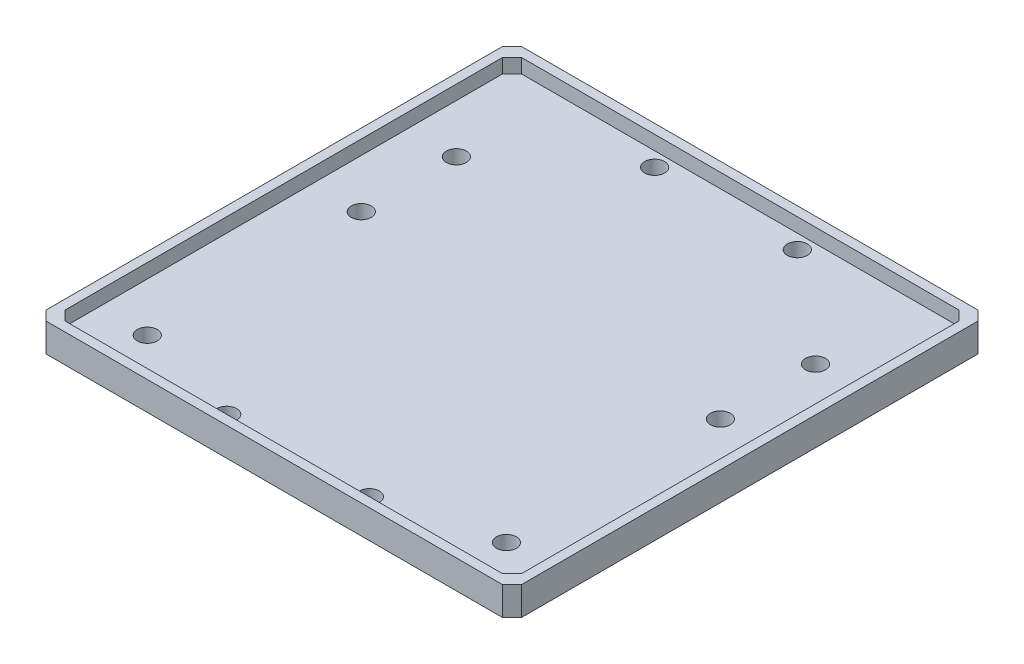
ISO-10303-21;
HEADER;
FILE_DESCRIPTION(('STEP AP214'),'2;1');
FILE_NAME('part.step','',(''),(''),'','','');
FILE_SCHEMA(('AUTOMOTIVE_DESIGN { 1 0 10303 214 1 1 1 1 }'));
ENDSEC;
DATA;
#1=APPLICATION_CONTEXT('core data for automotive mechanical design processes');
#2=APPLICATION_PROTOCOL_DEFINITION('international standard','automotive_design',2000,#1);
#3=PRODUCT_CONTEXT('',#1,'mechanical');
#4=PRODUCT('Part','Part','',(#3));
#5=PRODUCT_RELATED_PRODUCT_CATEGORY('part','',(#4));
#6=PRODUCT_DEFINITION_FORMATION('','',#4);
#7=PRODUCT_DEFINITION_CONTEXT('part definition',#1,'design');
#8=PRODUCT_DEFINITION('design','',#6,#7);
#9=PRODUCT_DEFINITION_SHAPE('','',#8);
#10=(LENGTH_UNIT() NAMED_UNIT(*) SI_UNIT(.MILLI.,.METRE.));
#11=(NAMED_UNIT(*) PLANE_ANGLE_UNIT() SI_UNIT($,.RADIAN.));
#12=(NAMED_UNIT(*) SI_UNIT($,.STERADIAN.) SOLID_ANGLE_UNIT());
#13=UNCERTAINTY_MEASURE_WITH_UNIT(LENGTH_MEASURE(1.E-05),#10,'distance_accuracy_value','');
#14=(GEOMETRIC_REPRESENTATION_CONTEXT(3) GLOBAL_UNCERTAINTY_ASSIGNED_CONTEXT((#13)) GLOBAL_UNIT_ASSIGNED_CONTEXT((#10,
#11,#12)) REPRESENTATION_CONTEXT('',''));
#15=CARTESIAN_POINT('',(0.,0.,0.));
#16=DIRECTION('',(0.,0.,1.));
#17=DIRECTION('',(1.,0.,0.));
#18=AXIS2_PLACEMENT_3D('',#15,#16,#17);
#19=CARTESIAN_POINT('',(0.,3.,0.));
#20=DIRECTION('',(0.,1.,0.));
#21=DIRECTION('',(0.,0.,1.));
#22=AXIS2_PLACEMENT_3D('',#19,#20,#21);
#23=PLANE('',#22);
#24=CARTESIAN_POINT('',(77.2035074999913,3.,87.3604147454228));
#25=DIRECTION('',(0.,1.,0.));
#26=DIRECTION('',(0.,0.,-1.));
#27=AXIS2_PLACEMENT_3D('',#24,#25,#26);
#28=CIRCLE('',#27,2.09999999999997);
#29=CARTESIAN_POINT('',(77.2035074999913,3.,85.2604147454228));
#30=VERTEX_POINT('',#29);
#31=EDGE_CURVE('E213',#30,#30,#28,.T.);
#32=ORIENTED_EDGE('',*,*,#31,.F.);
#33=EDGE_LOOP('',(#32));
#34=FACE_BOUND('',#33,.T.);
#35=CARTESIAN_POINT('',(77.2035074999913,3.,152.360414745423));
#36=DIRECTION('',(0.,1.,0.));
#37=DIRECTION('',(0.,0.,-1.));
#38=AXIS2_PLACEMENT_3D('',#35,#36,#37);
#39=CIRCLE('',#38,2.09999999999999);
#40=CARTESIAN_POINT('',(77.2035074999913,3.,150.260414745423));
#41=VERTEX_POINT('',#40);
#42=EDGE_CURVE('E229',#41,#41,#39,.T.);
#43=ORIENTED_EDGE('',*,*,#42,.F.);
#44=EDGE_LOOP('',(#43));
#45=FACE_BOUND('',#44,.T.);
#46=CARTESIAN_POINT('',(24.4441539849667,3.,68.4248216350618));
#47=DIRECTION('',(0.,1.,0.));
#48=DIRECTION('',(0.,0.,1.));
#49=AXIS2_PLACEMENT_3D('',#46,#47,#48);
#50=CIRCLE('',#49,2.1);
#51=CARTESIAN_POINT('',(24.4441539849667,3.,70.5248216350618));
#52=VERTEX_POINT('',#51);
#53=EDGE_CURVE('E245',#52,#52,#50,.T.);
#54=ORIENTED_EDGE('',*,*,#53,.F.);
#55=EDGE_LOOP('',(#54));
#56=FACE_BOUND('',#55,.T.);
#57=CARTESIAN_POINT('',(1.68480046994186,3.,152.360414745423));
#58=DIRECTION('',(0.,1.,0.));
#59=DIRECTION('',(0.,0.,1.));
#60=AXIS2_PLACEMENT_3D('',#57,#58,#59);
#61=CIRCLE('',#60,2.1);
#62=CARTESIAN_POINT('',(1.68480046994186,3.,154.460414745423));
#63=VERTEX_POINT('',#62);
#64=EDGE_CURVE('E261',#63,#63,#61,.T.);
#65=ORIENTED_EDGE('',*,*,#64,.F.);
#66=EDGE_LOOP('',(#65));
#67=FACE_BOUND('',#66,.T.);
#68=CARTESIAN_POINT('',(1.68480046994187,3.,87.3604147454228));
#69=DIRECTION('',(0.,1.,0.));
#70=DIRECTION('',(0.,0.,1.));
#71=AXIS2_PLACEMENT_3D('',#68,#69,#70);
#72=CIRCLE('',#71,2.09999999999998);
#73=CARTESIAN_POINT('',(1.68480046994187,3.,89.4604147454228));
#74=VERTEX_POINT('',#73);
#75=EDGE_CURVE('E277',#74,#74,#72,.T.);
#76=ORIENTED_EDGE('',*,*,#75,.F.);
#77=EDGE_LOOP('',(#76));
#78=FACE_BOUND('',#77,.T.);
#79=CARTESIAN_POINT('',(1.68480046994187,3.,107.360414745423));
#80=DIRECTION('',(0.,1.,0.));
#81=DIRECTION('',(0.,0.,1.));
#82=AXIS2_PLACEMENT_3D('',#79,#80,#81);
#83=CIRCLE('',#82,2.10000000000001);
#84=CARTESIAN_POINT('',(1.68480046994187,3.,109.460414745423));
#85=VERTEX_POINT('',#84);
#86=EDGE_CURVE('E269',#85,#85,#83,.T.);
#87=ORIENTED_EDGE('',*,*,#86,.F.);
#88=EDGE_LOOP('',(#87));
#89=FACE_BOUND('',#88,.T.);
#90=CARTESIAN_POINT('',(24.4441539849667,3.,158.424821635062));
#91=DIRECTION('',(0.,1.,0.));
#92=DIRECTION('',(0.,0.,1.));
#93=AXIS2_PLACEMENT_3D('',#90,#91,#92);
#94=CIRCLE('',#93,2.09999999999999);
#95=CARTESIAN_POINT('',(24.4441539849667,3.,160.524821635062));
#96=VERTEX_POINT('',#95);
#97=EDGE_CURVE('E253',#96,#96,#94,.T.);
#98=ORIENTED_EDGE('',*,*,#97,.F.);
#99=EDGE_LOOP('',(#98));
#100=FACE_BOUND('',#99,.T.);
#101=CARTESIAN_POINT('',(54.4441539849665,3.,158.424821635062));
#102=DIRECTION('',(0.,1.,0.));
#103=DIRECTION('',(0.,0.,-1.));
#104=AXIS2_PLACEMENT_3D('',#101,#102,#103);
#105=CIRCLE('',#104,2.09999999999999);
#106=CARTESIAN_POINT('',(54.4441539849665,3.,156.324821635062));
#107=VERTEX_POINT('',#106);
#108=EDGE_CURVE('E237',#107,#107,#105,.T.);
#109=ORIENTED_EDGE('',*,*,#108,.F.);
#110=EDGE_LOOP('',(#109));
#111=FACE_BOUND('',#110,.T.);
#112=CARTESIAN_POINT('',(77.2035074999913,3.,107.360414745423));
#113=DIRECTION('',(0.,1.,0.));
#114=DIRECTION('',(0.,0.,-1.));
#115=AXIS2_PLACEMENT_3D('',#112,#113,#114);
#116=CIRCLE('',#115,2.10000000000002);
#117=CARTESIAN_POINT('',(77.2035074999913,3.,105.260414745423));
#118=VERTEX_POINT('',#117);
#119=EDGE_CURVE('E221',#118,#118,#116,.T.);
#120=ORIENTED_EDGE('',*,*,#119,.F.);
#121=EDGE_LOOP('',(#120));
#122=FACE_BOUND('',#121,.T.);
#123=CARTESIAN_POINT('',(54.4441539849665,3.,68.4248216350618));
#124=DIRECTION('',(0.,1.,0.));
#125=DIRECTION('',(0.,0.,-1.));
#126=AXIS2_PLACEMENT_3D('',#123,#124,#125);
#127=CIRCLE('',#126,2.1);
#128=CARTESIAN_POINT('',(54.4441539849665,3.,66.3248216350618));
#129=VERTEX_POINT('',#128);
#130=EDGE_CURVE('E203',#129,#129,#127,.T.);
#131=ORIENTED_EDGE('',*,*,#130,.F.);
#132=EDGE_LOOP('',(#131));
#133=FACE_BOUND('',#132,.T.);
#134=DIRECTION('',(0.,0.,-1.));
#135=VECTOR('',#134,1.);
#136=CARTESIAN_POINT('',(-8.55584601503339,3.,163.424821635062));
#137=LINE('',#136,#135);
#138=CARTESIAN_POINT('',(-8.55584601503339,3.,159.424821635062));
#139=VERTEX_POINT('',#138);
#140=CARTESIAN_POINT('',(-8.55584601503339,3.,67.4248216350618));
#141=VERTEX_POINT('',#140);
#142=EDGE_CURVE('E187',#139,#141,#137,.T.);
#143=ORIENTED_EDGE('',*,*,#142,.F.);
#144=DIRECTION('',(-0.707106781186547,0.,-0.707106781186548));
#145=VECTOR('',#144,1.);
#146=CARTESIAN_POINT('',(-6.55584601503339,3.,161.424821635062));
#147=LINE('',#146,#145);
#148=CARTESIAN_POINT('',(-6.55584601503339,3.,161.424821635062));
#149=VERTEX_POINT('',#148);
#150=EDGE_CURVE('E170',#149,#139,#147,.T.);
#151=ORIENTED_EDGE('',*,*,#150,.F.);
#152=DIRECTION('',(-1.,0.,0.));
#153=VECTOR('',#152,1.);
#154=CARTESIAN_POINT('',(-8.55584601503339,3.,161.424821635062));
#155=LINE('',#154,#153);
#156=CARTESIAN_POINT('',(85.4441539849666,3.,161.424821635062));
#157=VERTEX_POINT('',#156);
#158=EDGE_CURVE('E534',#157,#149,#155,.T.);
#159=ORIENTED_EDGE('',*,*,#158,.F.);
#160=DIRECTION('',(-0.707106781186545,0.,0.70710678118655));
#161=VECTOR('',#160,1.);
#162=CARTESIAN_POINT('',(85.4441539849666,3.,161.424821635062));
#163=LINE('',#162,#161);
#164=CARTESIAN_POINT('',(87.4441539849666,3.,159.424821635062));
#165=VERTEX_POINT('',#164);
#166=EDGE_CURVE('E179',#165,#157,#163,.T.);
#167=ORIENTED_EDGE('',*,*,#166,.F.);
#168=DIRECTION('',(0.,0.,-1.));
#169=VECTOR('',#168,1.);
#170=CARTESIAN_POINT('',(87.4441539849667,3.,0.));
#171=LINE('',#170,#169);
#172=CARTESIAN_POINT('',(87.4441539849666,3.,67.4248216350618));
#173=VERTEX_POINT('',#172);
#174=EDGE_CURVE('E196',#165,#173,#171,.T.);
#175=ORIENTED_EDGE('',*,*,#174,.T.);
#176=DIRECTION('',(0.707106781186545,0.,0.70710678118655));
#177=VECTOR('',#176,1.);
#178=CARTESIAN_POINT('',(85.4441539849666,3.,65.4248216350618));
#179=LINE('',#178,#177);
#180=CARTESIAN_POINT('',(85.4441539849666,3.,65.4248216350618));
#181=VERTEX_POINT('',#180);
#182=EDGE_CURVE('E559',#181,#173,#179,.T.);
#183=ORIENTED_EDGE('',*,*,#182,.F.);
#184=DIRECTION('',(1.,0.,0.));
#185=VECTOR('',#184,1.);
#186=CARTESIAN_POINT('',(0.,3.,65.4248216350618));
#187=LINE('',#186,#185);
#188=CARTESIAN_POINT('',(-6.55584601503339,3.,65.4248216350618));
#189=VERTEX_POINT('',#188);
#190=EDGE_CURVE('E201',#189,#181,#187,.T.);
#191=ORIENTED_EDGE('',*,*,#190,.F.);
#192=DIRECTION('',(0.707106781186547,0.,-0.707106781186548));
#193=VECTOR('',#192,1.);
#194=CARTESIAN_POINT('',(-6.55584601503339,3.,65.4248216350618));
#195=LINE('',#194,#193);
#196=EDGE_CURVE('E531',#141,#189,#195,.T.);
#197=ORIENTED_EDGE('',*,*,#196,.F.);
#198=EDGE_LOOP('',(#143,#151,#159,#167,#175,#183,#191,#197));
#199=FACE_BOUND('',#198,.T.);
#200=ADVANCED_FACE('F43',(#34,#45,#56,#67,#78,#89,#100,#111,#122,#133,#199),#23,.T.);
#201=CARTESIAN_POINT('',(-8.55584601503339,6.,161.424821635062));
#202=DIRECTION('',(0.,0.,1.));
#203=DIRECTION('',(1.,0.,0.));
#204=AXIS2_PLACEMENT_3D('',#201,#202,#203);
#205=PLANE('',#204);
#206=DIRECTION('',(0.,-1.,0.));
#207=VECTOR('',#206,1.);
#208=CARTESIAN_POINT('',(-6.55584601503339,6.,161.424821635062));
#209=LINE('',#208,#207);
#210=CARTESIAN_POINT('',(-6.55584601503339,6.,161.424821635062));
#211=VERTEX_POINT('',#210);
#212=EDGE_CURVE('E169',#211,#149,#209,.T.);
#213=ORIENTED_EDGE('',*,*,#212,.F.);
#214=DIRECTION('',(-1.,0.,0.));
#215=VECTOR('',#214,1.);
#216=CARTESIAN_POINT('',(-8.55584601503339,6.,161.424821635062));
#217=LINE('',#216,#215);
#218=CARTESIAN_POINT('',(85.4441539849666,6.,161.424821635062));
#219=VERTEX_POINT('',#218);
#220=EDGE_CURVE('E165',#219,#211,#217,.T.);
#221=ORIENTED_EDGE('',*,*,#220,.F.);
#222=DIRECTION('',(0.,-1.,0.));
#223=VECTOR('',#222,1.);
#224=CARTESIAN_POINT('',(85.4441539849666,6.,161.424821635062));
#225=LINE('',#224,#223);
#226=EDGE_CURVE('E60',#219,#157,#225,.T.);
#227=ORIENTED_EDGE('',*,*,#226,.T.);
#228=ORIENTED_EDGE('',*,*,#158,.T.);
#229=EDGE_LOOP('',(#213,#221,#227,#228));
#230=FACE_BOUND('',#229,.T.);
#231=ADVANCED_FACE('F398',(#230),#205,.F.);
#232=CARTESIAN_POINT('',(-8.55584601503339,6.,163.424821635062));
#233=DIRECTION('',(-1.,0.,0.));
#234=DIRECTION('',(0.,0.,1.));
#235=AXIS2_PLACEMENT_3D('',#232,#233,#234);
#236=PLANE('',#235);
#237=DIRECTION('',(0.,-1.,0.));
#238=VECTOR('',#237,1.);
#239=CARTESIAN_POINT('',(-8.55584601503339,6.,159.424821635062));
#240=LINE('',#239,#238);
#241=CARTESIAN_POINT('',(-8.55584601503339,6.,159.424821635062));
#242=VERTEX_POINT('',#241);
#243=EDGE_CURVE('E173',#242,#139,#240,.T.);
#244=ORIENTED_EDGE('',*,*,#243,.T.);
#245=ORIENTED_EDGE('',*,*,#142,.T.);
#246=DIRECTION('',(0.,-1.,0.));
#247=VECTOR('',#246,1.);
#248=CARTESIAN_POINT('',(-8.55584601503339,6.,67.4248216350618));
#249=LINE('',#248,#247);
#250=CARTESIAN_POINT('',(-8.55584601503339,6.,67.4248216350618));
#251=VERTEX_POINT('',#250);
#252=EDGE_CURVE('E184',#251,#141,#249,.T.);
#253=ORIENTED_EDGE('',*,*,#252,.F.);
#254=DIRECTION('',(0.,0.,-1.));
#255=VECTOR('',#254,1.);
#256=CARTESIAN_POINT('',(-8.55584601503339,6.,163.424821635062));
#257=LINE('',#256,#255);
#258=EDGE_CURVE('E163',#242,#251,#257,.T.);
#259=ORIENTED_EDGE('',*,*,#258,.F.);
#260=EDGE_LOOP('',(#244,#245,#253,#259));
#261=FACE_BOUND('',#260,.T.);
#262=ADVANCED_FACE('F182',(#261),#236,.F.);
#263=CARTESIAN_POINT('',(87.4441539849667,6.,0.));
#264=DIRECTION('',(-1.,0.,0.));
#265=DIRECTION('',(0.,0.,1.));
#266=AXIS2_PLACEMENT_3D('',#263,#264,#265);
#267=PLANE('',#266);
#268=ORIENTED_EDGE('',*,*,#174,.F.);
#269=DIRECTION('',(0.,-1.,0.));
#270=VECTOR('',#269,1.);
#271=CARTESIAN_POINT('',(87.4441539849666,6.,159.424821635062));
#272=LINE('',#271,#270);
#273=CARTESIAN_POINT('',(87.4441539849666,6.,159.424821635062));
#274=VERTEX_POINT('',#273);
#275=EDGE_CURVE('E569',#274,#165,#272,.T.);
#276=ORIENTED_EDGE('',*,*,#275,.F.);
#277=DIRECTION('',(0.,0.,-1.));
#278=VECTOR('',#277,1.);
#279=CARTESIAN_POINT('',(87.4441539849667,6.,0.));
#280=LINE('',#279,#278);
#281=CARTESIAN_POINT('',(87.4441539849666,6.,67.4248216350618));
#282=VERTEX_POINT('',#281);
#283=EDGE_CURVE('E358',#274,#282,#280,.T.);
#284=ORIENTED_EDGE('',*,*,#283,.T.);
#285=DIRECTION('',(0.,-1.,0.));
#286=VECTOR('',#285,1.);
#287=CARTESIAN_POINT('',(87.4441539849666,6.,67.4248216350618));
#288=LINE('',#287,#286);
#289=EDGE_CURVE('E565',#282,#173,#288,.T.);
#290=ORIENTED_EDGE('',*,*,#289,.T.);
#291=EDGE_LOOP('',(#268,#276,#284,#290));
#292=FACE_BOUND('',#291,.T.);
#293=ADVANCED_FACE('F447',(#292),#267,.T.);
#294=CARTESIAN_POINT('',(0.,6.,65.4248216350618));
#295=DIRECTION('',(0.,0.,-1.));
#296=DIRECTION('',(-1.,0.,0.));
#297=AXIS2_PLACEMENT_3D('',#294,#295,#296);
#298=PLANE('',#297);
#299=DIRECTION('',(0.,-1.,0.));
#300=VECTOR('',#299,1.);
#301=CARTESIAN_POINT('',(85.4441539849666,6.,65.4248216350618));
#302=LINE('',#301,#300);
#303=CARTESIAN_POINT('',(85.4441539849666,6.,65.4248216350618));
#304=VERTEX_POINT('',#303);
#305=EDGE_CURVE('E566',#304,#181,#302,.T.);
#306=ORIENTED_EDGE('',*,*,#305,.F.);
#307=DIRECTION('',(1.,0.,0.));
#308=VECTOR('',#307,1.);
#309=CARTESIAN_POINT('',(0.,6.,65.4248216350618));
#310=LINE('',#309,#308);
#311=CARTESIAN_POINT('',(-6.55584601503339,6.,65.4248216350618));
#312=VERTEX_POINT('',#311);
#313=EDGE_CURVE('E546',#312,#304,#310,.T.);
#314=ORIENTED_EDGE('',*,*,#313,.F.);
#315=DIRECTION('',(0.,-1.,0.));
#316=VECTOR('',#315,1.);
#317=CARTESIAN_POINT('',(-6.55584601503339,6.,65.4248216350618));
#318=LINE('',#317,#316);
#319=EDGE_CURVE('E68',#312,#189,#318,.T.);
#320=ORIENTED_EDGE('',*,*,#319,.T.);
#321=ORIENTED_EDGE('',*,*,#190,.T.);
#322=EDGE_LOOP('',(#306,#314,#320,#321));
#323=FACE_BOUND('',#322,.T.);
#324=ADVANCED_FACE('F414',(#323),#298,.F.);
#325=CARTESIAN_POINT('',(0.,0.,0.));
#326=DIRECTION('',(0.,1.,0.));
#327=DIRECTION('',(0.,0.,1.));
#328=AXIS2_PLACEMENT_3D('',#325,#326,#327);
#329=PLANE('',#328);
#330=DIRECTION('',(0.,0.,1.));
#331=VECTOR('',#330,1.);
#332=CARTESIAN_POINT('',(-10.5558460150334,0.,63.4248216350618));
#333=LINE('',#332,#331);
#334=CARTESIAN_POINT('',(-10.5558460150334,0.,65.4248216350618));
#335=VERTEX_POINT('',#334);
#336=CARTESIAN_POINT('',(-10.5558460150334,0.,161.424821635062));
#337=VERTEX_POINT('',#336);
#338=EDGE_CURVE('E281',#335,#337,#333,.T.);
#339=ORIENTED_EDGE('',*,*,#338,.F.);
#340=DIRECTION('',(-0.70710678118655,0.,0.707106781186545));
#341=VECTOR('',#340,1.);
#342=CARTESIAN_POINT('',(-10.5558460150334,0.,65.4248216350618));
#343=LINE('',#342,#341);
#344=CARTESIAN_POINT('',(-8.55584601503337,0.,63.4248216350618));
#345=VERTEX_POINT('',#344);
#346=EDGE_CURVE('E316',#335,#345,#343,.F.);
#347=ORIENTED_EDGE('',*,*,#346,.T.);
#348=DIRECTION('',(-1.,0.,0.));
#349=VECTOR('',#348,1.);
#350=CARTESIAN_POINT('',(-10.5558460150334,0.,63.4248216350618));
#351=LINE('',#350,#349);
#352=CARTESIAN_POINT('',(87.4441539849666,0.,63.4248216350618));
#353=VERTEX_POINT('',#352);
#354=EDGE_CURVE('E296',#353,#345,#351,.T.);
#355=ORIENTED_EDGE('',*,*,#354,.F.);
#356=DIRECTION('',(-0.707106781186545,0.,-0.70710678118655));
#357=VECTOR('',#356,1.);
#358=CARTESIAN_POINT('',(87.4441539849666,0.,63.4248216350618));
#359=LINE('',#358,#357);
#360=CARTESIAN_POINT('',(89.4441539849666,0.,65.4248216350618));
#361=VERTEX_POINT('',#360);
#362=EDGE_CURVE('E307',#353,#361,#359,.F.);
#363=ORIENTED_EDGE('',*,*,#362,.T.);
#364=DIRECTION('',(0.,0.,-1.));
#365=VECTOR('',#364,1.);
#366=CARTESIAN_POINT('',(89.4441539849666,0.,63.4248216350618));
#367=LINE('',#366,#365);
#368=CARTESIAN_POINT('',(89.4441539849666,0.,161.424821635062));
#369=VERTEX_POINT('',#368);
#370=EDGE_CURVE('E292',#369,#361,#367,.T.);
#371=ORIENTED_EDGE('',*,*,#370,.F.);
#372=DIRECTION('',(0.70710678118655,0.,-0.707106781186545));
#373=VECTOR('',#372,1.);
#374=CARTESIAN_POINT('',(89.4441539849666,0.,161.424821635062));
#375=LINE('',#374,#373);
#376=CARTESIAN_POINT('',(87.4441539849666,0.,163.424821635062));
#377=VERTEX_POINT('',#376);
#378=EDGE_CURVE('E310',#369,#377,#375,.F.);
#379=ORIENTED_EDGE('',*,*,#378,.T.);
#380=DIRECTION('',(1.,0.,0.));
#381=VECTOR('',#380,1.);
#382=CARTESIAN_POINT('',(-10.5558460150334,0.,163.424821635062));
#383=LINE('',#382,#381);
#384=CARTESIAN_POINT('',(-8.55584601503338,0.,163.424821635062));
#385=VERTEX_POINT('',#384);
#386=EDGE_CURVE('E288',#385,#377,#383,.T.);
#387=ORIENTED_EDGE('',*,*,#386,.F.);
#388=DIRECTION('',(0.707106781186543,0.,0.707106781186552));
#389=VECTOR('',#388,1.);
#390=CARTESIAN_POINT('',(-8.55584601503338,0.,163.424821635062));
#391=LINE('',#390,#389);
#392=EDGE_CURVE('E313',#385,#337,#391,.F.);
#393=ORIENTED_EDGE('',*,*,#392,.T.);
#394=EDGE_LOOP('',(#339,#347,#355,#363,#371,#379,#387,#393));
#395=FACE_BOUND('',#394,.T.);
#396=CARTESIAN_POINT('',(1.68480046994187,0.,87.3604147454228));
#397=DIRECTION('',(0.,1.,0.));
#398=DIRECTION('',(0.,0.,1.));
#399=AXIS2_PLACEMENT_3D('',#396,#397,#398);
#400=CIRCLE('',#399,2.09999999999998);
#401=CARTESIAN_POINT('',(1.68480046994187,0.,89.4604147454228));
#402=VERTEX_POINT('',#401);
#403=EDGE_CURVE('E273',#402,#402,#400,.T.);
#404=ORIENTED_EDGE('',*,*,#403,.T.);
#405=EDGE_LOOP('',(#404));
#406=FACE_BOUND('',#405,.T.);
#407=CARTESIAN_POINT('',(1.68480046994187,0.,107.360414745423));
#408=DIRECTION('',(0.,1.,0.));
#409=DIRECTION('',(0.,0.,1.));
#410=AXIS2_PLACEMENT_3D('',#407,#408,#409);
#411=CIRCLE('',#410,2.10000000000001);
#412=CARTESIAN_POINT('',(1.68480046994187,0.,109.460414745423));
#413=VERTEX_POINT('',#412);
#414=EDGE_CURVE('E265',#413,#413,#411,.T.);
#415=ORIENTED_EDGE('',*,*,#414,.T.);
#416=EDGE_LOOP('',(#415));
#417=FACE_BOUND('',#416,.T.);
#418=CARTESIAN_POINT('',(1.68480046994186,0.,152.360414745423));
#419=DIRECTION('',(0.,1.,0.));
#420=DIRECTION('',(0.,0.,1.));
#421=AXIS2_PLACEMENT_3D('',#418,#419,#420);
#422=CIRCLE('',#421,2.1);
#423=CARTESIAN_POINT('',(1.68480046994186,0.,154.460414745423));
#424=VERTEX_POINT('',#423);
#425=EDGE_CURVE('E257',#424,#424,#422,.T.);
#426=ORIENTED_EDGE('',*,*,#425,.T.);
#427=EDGE_LOOP('',(#426));
#428=FACE_BOUND('',#427,.T.);
#429=CARTESIAN_POINT('',(24.4441539849667,0.,158.424821635062));
#430=DIRECTION('',(0.,1.,0.));
#431=DIRECTION('',(0.,0.,1.));
#432=AXIS2_PLACEMENT_3D('',#429,#430,#431);
#433=CIRCLE('',#432,2.09999999999999);
#434=CARTESIAN_POINT('',(24.4441539849667,0.,160.524821635062));
#435=VERTEX_POINT('',#434);
#436=EDGE_CURVE('E249',#435,#435,#433,.T.);
#437=ORIENTED_EDGE('',*,*,#436,.T.);
#438=EDGE_LOOP('',(#437));
#439=FACE_BOUND('',#438,.T.);
#440=CARTESIAN_POINT('',(24.4441539849667,0.,68.4248216350618));
#441=DIRECTION('',(0.,1.,0.));
#442=DIRECTION('',(0.,0.,1.));
#443=AXIS2_PLACEMENT_3D('',#440,#441,#442);
#444=CIRCLE('',#443,2.1);
#445=CARTESIAN_POINT('',(24.4441539849667,0.,70.5248216350618));
#446=VERTEX_POINT('',#445);
#447=EDGE_CURVE('E241',#446,#446,#444,.T.);
#448=ORIENTED_EDGE('',*,*,#447,.T.);
#449=EDGE_LOOP('',(#448));
#450=FACE_BOUND('',#449,.T.);
#451=CARTESIAN_POINT('',(54.4441539849665,0.,158.424821635062));
#452=DIRECTION('',(0.,1.,0.));
#453=DIRECTION('',(0.,0.,-1.));
#454=AXIS2_PLACEMENT_3D('',#451,#452,#453);
#455=CIRCLE('',#454,2.09999999999999);
#456=CARTESIAN_POINT('',(54.4441539849665,0.,156.324821635062));
#457=VERTEX_POINT('',#456);
#458=EDGE_CURVE('E233',#457,#457,#455,.T.);
#459=ORIENTED_EDGE('',*,*,#458,.T.);
#460=EDGE_LOOP('',(#459));
#461=FACE_BOUND('',#460,.T.);
#462=CARTESIAN_POINT('',(77.2035074999913,0.,152.360414745423));
#463=DIRECTION('',(0.,1.,0.));
#464=DIRECTION('',(0.,0.,-1.));
#465=AXIS2_PLACEMENT_3D('',#462,#463,#464);
#466=CIRCLE('',#465,2.09999999999999);
#467=CARTESIAN_POINT('',(77.2035074999913,0.,150.260414745423));
#468=VERTEX_POINT('',#467);
#469=EDGE_CURVE('E225',#468,#468,#466,.T.);
#470=ORIENTED_EDGE('',*,*,#469,.T.);
#471=EDGE_LOOP('',(#470));
#472=FACE_BOUND('',#471,.T.);
#473=CARTESIAN_POINT('',(77.2035074999913,0.,107.360414745423));
#474=DIRECTION('',(0.,1.,0.));
#475=DIRECTION('',(0.,0.,-1.));
#476=AXIS2_PLACEMENT_3D('',#473,#474,#475);
#477=CIRCLE('',#476,2.10000000000002);
#478=CARTESIAN_POINT('',(77.2035074999913,0.,105.260414745423));
#479=VERTEX_POINT('',#478);
#480=EDGE_CURVE('E217',#479,#479,#477,.T.);
#481=ORIENTED_EDGE('',*,*,#480,.T.);
#482=EDGE_LOOP('',(#481));
#483=FACE_BOUND('',#482,.T.);
#484=CARTESIAN_POINT('',(77.2035074999913,0.,87.3604147454228));
#485=DIRECTION('',(0.,1.,0.));
#486=DIRECTION('',(0.,0.,-1.));
#487=AXIS2_PLACEMENT_3D('',#484,#485,#486);
#488=CIRCLE('',#487,2.09999999999997);
#489=CARTESIAN_POINT('',(77.2035074999913,0.,85.2604147454228));
#490=VERTEX_POINT('',#489);
#491=EDGE_CURVE('E207',#490,#490,#488,.T.);
#492=ORIENTED_EDGE('',*,*,#491,.T.);
#493=EDGE_LOOP('',(#492));
#494=FACE_BOUND('',#493,.T.);
#495=CARTESIAN_POINT('',(54.4441539849665,0.,68.4248216350618));
#496=DIRECTION('',(0.,1.,0.));
#497=DIRECTION('',(0.,0.,-1.));
#498=AXIS2_PLACEMENT_3D('',#495,#496,#497);
#499=CIRCLE('',#498,2.1);
#500=CARTESIAN_POINT('',(54.4441539849665,0.,66.3248216350618));
#501=VERTEX_POINT('',#500);
#502=EDGE_CURVE('E208',#501,#501,#499,.T.);
#503=ORIENTED_EDGE('',*,*,#502,.T.);
#504=EDGE_LOOP('',(#503));
#505=FACE_BOUND('',#504,.T.);
#506=ADVANCED_FACE('F368',(#395,#406,#417,#428,#439,#450,#461,#472,#483,#494,#505),#329,.F.);
#507=CARTESIAN_POINT('',(-10.5558460150334,3.,63.4248216350618));
#508=DIRECTION('',(1.,0.,0.));
#509=DIRECTION('',(0.,0.,-1.));
#510=AXIS2_PLACEMENT_3D('',#507,#508,#509);
#511=PLANE('',#510);
#512=DIRECTION('',(0.,0.,-1.));
#513=VECTOR('',#512,1.);
#514=CARTESIAN_POINT('',(-10.5558460150334,6.,163.424821635062));
#515=LINE('',#514,#513);
#516=CARTESIAN_POINT('',(-10.5558460150334,6.,161.424821635062));
#517=VERTEX_POINT('',#516);
#518=CARTESIAN_POINT('',(-10.5558460150334,6.,65.4248216350618));
#519=VERTEX_POINT('',#518);
#520=EDGE_CURVE('E186',#517,#519,#515,.T.);
#521=ORIENTED_EDGE('',*,*,#520,.T.);
#522=DIRECTION('',(0.,-1.,0.));
#523=VECTOR('',#522,1.);
#524=CARTESIAN_POINT('',(-10.5558460150334,3.,65.4248216350618));
#525=LINE('',#524,#523);
#526=EDGE_CURVE('E303',#519,#335,#525,.T.);
#527=ORIENTED_EDGE('',*,*,#526,.T.);
#528=ORIENTED_EDGE('',*,*,#338,.T.);
#529=DIRECTION('',(0.,1.,0.));
#530=VECTOR('',#529,1.);
#531=CARTESIAN_POINT('',(-10.5558460150334,3.,161.424821635062));
#532=LINE('',#531,#530);
#533=EDGE_CURVE('E300',#337,#517,#532,.T.);
#534=ORIENTED_EDGE('',*,*,#533,.T.);
#535=EDGE_LOOP('',(#521,#527,#528,#534));
#536=FACE_BOUND('',#535,.T.);
#537=ADVANCED_FACE('F375',(#536),#511,.F.);
#538=CARTESIAN_POINT('',(-10.5558460150334,3.,163.424821635062));
#539=DIRECTION('',(0.,0.,-1.));
#540=DIRECTION('',(-1.,0.,0.));
#541=AXIS2_PLACEMENT_3D('',#538,#539,#540);
#542=PLANE('',#541);
#543=DIRECTION('',(1.,0.,0.));
#544=VECTOR('',#543,1.);
#545=CARTESIAN_POINT('',(-10.5558460150334,6.,163.424821635062));
#546=LINE('',#545,#544);
#547=CARTESIAN_POINT('',(-8.55584601503338,6.,163.424821635062));
#548=VERTEX_POINT('',#547);
#549=CARTESIAN_POINT('',(87.4441539849666,6.,163.424821635062));
#550=VERTEX_POINT('',#549);
#551=EDGE_CURVE('E192',#548,#550,#546,.T.);
#552=ORIENTED_EDGE('',*,*,#551,.F.);
#553=DIRECTION('',(0.,-1.,0.));
#554=VECTOR('',#553,1.);
#555=CARTESIAN_POINT('',(-8.55584601503338,3.,163.424821635062));
#556=LINE('',#555,#554);
#557=EDGE_CURVE('E341',#548,#385,#556,.T.);
#558=ORIENTED_EDGE('',*,*,#557,.T.);
#559=ORIENTED_EDGE('',*,*,#386,.T.);
#560=DIRECTION('',(0.,1.,0.));
#561=VECTOR('',#560,1.);
#562=CARTESIAN_POINT('',(87.4441539849666,3.,163.424821635062));
#563=LINE('',#562,#561);
#564=EDGE_CURVE('E338',#377,#550,#563,.T.);
#565=ORIENTED_EDGE('',*,*,#564,.T.);
#566=EDGE_LOOP('',(#552,#558,#559,#565));
#567=FACE_BOUND('',#566,.T.);
#568=ADVANCED_FACE('F385',(#567),#542,.F.);
#569=CARTESIAN_POINT('',(89.4441539849666,3.,63.4248216350618));
#570=DIRECTION('',(-1.,0.,0.));
#571=DIRECTION('',(0.,0.,1.));
#572=AXIS2_PLACEMENT_3D('',#569,#570,#571);
#573=PLANE('',#572);
#574=DIRECTION('',(0.,0.,-1.));
#575=VECTOR('',#574,1.);
#576=CARTESIAN_POINT('',(89.4441539849666,6.,0.));
#577=LINE('',#576,#575);
#578=CARTESIAN_POINT('',(89.4441539849666,6.,161.424821635062));
#579=VERTEX_POINT('',#578);
#580=CARTESIAN_POINT('',(89.4441539849666,6.,65.4248216350618));
#581=VERTEX_POINT('',#580);
#582=EDGE_CURVE('E212',#579,#581,#577,.T.);
#583=ORIENTED_EDGE('',*,*,#582,.F.);
#584=DIRECTION('',(0.,-1.,0.));
#585=VECTOR('',#584,1.);
#586=CARTESIAN_POINT('',(89.4441539849666,3.,161.424821635062));
#587=LINE('',#586,#585);
#588=EDGE_CURVE('E11',#579,#369,#587,.T.);
#589=ORIENTED_EDGE('',*,*,#588,.T.);
#590=ORIENTED_EDGE('',*,*,#370,.T.);
#591=DIRECTION('',(0.,1.,0.));
#592=VECTOR('',#591,1.);
#593=CARTESIAN_POINT('',(89.4441539849666,3.,65.4248216350618));
#594=LINE('',#593,#592);
#595=EDGE_CURVE('E53',#361,#581,#594,.T.);
#596=ORIENTED_EDGE('',*,*,#595,.T.);
#597=EDGE_LOOP('',(#583,#589,#590,#596));
#598=FACE_BOUND('',#597,.T.);
#599=ADVANCED_FACE('F349',(#598),#573,.F.);
#600=CARTESIAN_POINT('',(-10.5558460150334,3.,63.4248216350618));
#601=DIRECTION('',(0.,0.,1.));
#602=DIRECTION('',(1.,0.,0.));
#603=AXIS2_PLACEMENT_3D('',#600,#601,#602);
#604=PLANE('',#603);
#605=ORIENTED_EDGE('',*,*,#354,.T.);
#606=DIRECTION('',(0.,1.,0.));
#607=VECTOR('',#606,1.);
#608=CARTESIAN_POINT('',(-8.55584601503337,3.,63.4248216350618));
#609=LINE('',#608,#607);
#610=CARTESIAN_POINT('',(-8.55584601503337,6.,63.4248216350618));
#611=VERTEX_POINT('',#610);
#612=EDGE_CURVE('E323',#345,#611,#609,.T.);
#613=ORIENTED_EDGE('',*,*,#612,.T.);
#614=DIRECTION('',(-1.,0.,0.));
#615=VECTOR('',#614,1.);
#616=CARTESIAN_POINT('',(0.,6.,63.4248216350618));
#617=LINE('',#616,#615);
#618=CARTESIAN_POINT('',(87.4441539849666,6.,63.4248216350618));
#619=VERTEX_POINT('',#618);
#620=EDGE_CURVE('E365',#619,#611,#617,.T.);
#621=ORIENTED_EDGE('',*,*,#620,.F.);
#622=DIRECTION('',(0.,-1.,0.));
#623=VECTOR('',#622,1.);
#624=CARTESIAN_POINT('',(87.4441539849666,3.,63.4248216350618));
#625=LINE('',#624,#623);
#626=EDGE_CURVE('E319',#619,#353,#625,.T.);
#627=ORIENTED_EDGE('',*,*,#626,.T.);
#628=EDGE_LOOP('',(#605,#613,#621,#627));
#629=FACE_BOUND('',#628,.T.);
#630=ADVANCED_FACE('F363',(#629),#604,.F.);
#631=CARTESIAN_POINT('',(1.68480046994187,3.,87.3604147454228));
#632=DIRECTION('',(0.,-1.,0.));
#633=DIRECTION('',(0.,0.,-1.));
#634=AXIS2_PLACEMENT_3D('',#631,#632,#633);
#635=CYLINDRICAL_SURFACE('',#634,2.09999999999998);
#636=ORIENTED_EDGE('',*,*,#75,.T.);
#637=EDGE_LOOP('',(#636));
#638=FACE_BOUND('',#637,.T.);
#639=ORIENTED_EDGE('',*,*,#403,.F.);
#640=EDGE_LOOP('',(#639));
#641=FACE_BOUND('',#640,.T.);
#642=ADVANCED_FACE('F410',(#638,#641),#635,.F.);
#643=CARTESIAN_POINT('',(1.68480046994187,3.,107.360414745423));
#644=DIRECTION('',(0.,-1.,0.));
#645=DIRECTION('',(0.,0.,-1.));
#646=AXIS2_PLACEMENT_3D('',#643,#644,#645);
#647=CYLINDRICAL_SURFACE('',#646,2.10000000000001);
#648=ORIENTED_EDGE('',*,*,#86,.T.);
#649=EDGE_LOOP('',(#648));
#650=FACE_BOUND('',#649,.T.);
#651=ORIENTED_EDGE('',*,*,#414,.F.);
#652=EDGE_LOOP('',(#651));
#653=FACE_BOUND('',#652,.T.);
#654=ADVANCED_FACE('F481',(#650,#653),#647,.F.);
#655=CARTESIAN_POINT('',(1.68480046994186,3.,152.360414745423));
#656=DIRECTION('',(0.,-1.,0.));
#657=DIRECTION('',(0.,0.,-1.));
#658=AXIS2_PLACEMENT_3D('',#655,#656,#657);
#659=CYLINDRICAL_SURFACE('',#658,2.1);
#660=ORIENTED_EDGE('',*,*,#64,.T.);
#661=EDGE_LOOP('',(#660));
#662=FACE_BOUND('',#661,.T.);
#663=ORIENTED_EDGE('',*,*,#425,.F.);
#664=EDGE_LOOP('',(#663));
#665=FACE_BOUND('',#664,.T.);
#666=ADVANCED_FACE('F478',(#662,#665),#659,.F.);
#667=CARTESIAN_POINT('',(24.4441539849667,3.,158.424821635062));
#668=DIRECTION('',(0.,-1.,0.));
#669=DIRECTION('',(0.,0.,-1.));
#670=AXIS2_PLACEMENT_3D('',#667,#668,#669);
#671=CYLINDRICAL_SURFACE('',#670,2.09999999999999);
#672=ORIENTED_EDGE('',*,*,#97,.T.);
#673=EDGE_LOOP('',(#672));
#674=FACE_BOUND('',#673,.T.);
#675=ORIENTED_EDGE('',*,*,#436,.F.);
#676=EDGE_LOOP('',(#675));
#677=FACE_BOUND('',#676,.T.);
#678=ADVANCED_FACE('F474',(#674,#677),#671,.F.);
#679=CARTESIAN_POINT('',(24.4441539849667,3.,68.4248216350618));
#680=DIRECTION('',(0.,-1.,0.));
#681=DIRECTION('',(0.,0.,-1.));
#682=AXIS2_PLACEMENT_3D('',#679,#680,#681);
#683=CYLINDRICAL_SURFACE('',#682,2.1);
#684=ORIENTED_EDGE('',*,*,#53,.T.);
#685=EDGE_LOOP('',(#684));
#686=FACE_BOUND('',#685,.T.);
#687=ORIENTED_EDGE('',*,*,#447,.F.);
#688=EDGE_LOOP('',(#687));
#689=FACE_BOUND('',#688,.T.);
#690=ADVANCED_FACE('F470',(#686,#689),#683,.F.);
#691=CARTESIAN_POINT('',(54.4441539849665,3.,158.424821635062));
#692=DIRECTION('',(0.,-1.,0.));
#693=DIRECTION('',(0.,0.,-1.));
#694=AXIS2_PLACEMENT_3D('',#691,#692,#693);
#695=CYLINDRICAL_SURFACE('',#694,2.09999999999999);
#696=ORIENTED_EDGE('',*,*,#108,.T.);
#697=EDGE_LOOP('',(#696));
#698=FACE_BOUND('',#697,.T.);
#699=ORIENTED_EDGE('',*,*,#458,.F.);
#700=EDGE_LOOP('',(#699));
#701=FACE_BOUND('',#700,.T.);
#702=ADVANCED_FACE('F466',(#698,#701),#695,.F.);
#703=CARTESIAN_POINT('',(77.2035074999913,3.,152.360414745423));
#704=DIRECTION('',(0.,-1.,0.));
#705=DIRECTION('',(0.,0.,-1.));
#706=AXIS2_PLACEMENT_3D('',#703,#704,#705);
#707=CYLINDRICAL_SURFACE('',#706,2.09999999999999);
#708=ORIENTED_EDGE('',*,*,#42,.T.);
#709=EDGE_LOOP('',(#708));
#710=FACE_BOUND('',#709,.T.);
#711=ORIENTED_EDGE('',*,*,#469,.F.);
#712=EDGE_LOOP('',(#711));
#713=FACE_BOUND('',#712,.T.);
#714=ADVANCED_FACE('F462',(#710,#713),#707,.F.);
#715=CARTESIAN_POINT('',(77.2035074999913,3.,107.360414745423));
#716=DIRECTION('',(0.,-1.,0.));
#717=DIRECTION('',(0.,0.,-1.));
#718=AXIS2_PLACEMENT_3D('',#715,#716,#717);
#719=CYLINDRICAL_SURFACE('',#718,2.10000000000002);
#720=ORIENTED_EDGE('',*,*,#119,.T.);
#721=EDGE_LOOP('',(#720));
#722=FACE_BOUND('',#721,.T.);
#723=ORIENTED_EDGE('',*,*,#480,.F.);
#724=EDGE_LOOP('',(#723));
#725=FACE_BOUND('',#724,.T.);
#726=ADVANCED_FACE('F458',(#722,#725),#719,.F.);
#727=CARTESIAN_POINT('',(77.2035074999913,3.,87.3604147454228));
#728=DIRECTION('',(0.,-1.,0.));
#729=DIRECTION('',(0.,0.,-1.));
#730=AXIS2_PLACEMENT_3D('',#727,#728,#729);
#731=CYLINDRICAL_SURFACE('',#730,2.09999999999997);
#732=ORIENTED_EDGE('',*,*,#31,.T.);
#733=EDGE_LOOP('',(#732));
#734=FACE_BOUND('',#733,.T.);
#735=ORIENTED_EDGE('',*,*,#491,.F.);
#736=EDGE_LOOP('',(#735));
#737=FACE_BOUND('',#736,.T.);
#738=ADVANCED_FACE('F442',(#734,#737),#731,.F.);
#739=CARTESIAN_POINT('',(54.4441539849665,3.,68.4248216350618));
#740=DIRECTION('',(0.,-1.,0.));
#741=DIRECTION('',(0.,0.,-1.));
#742=AXIS2_PLACEMENT_3D('',#739,#740,#741);
#743=CYLINDRICAL_SURFACE('',#742,2.1);
#744=ORIENTED_EDGE('',*,*,#130,.T.);
#745=EDGE_LOOP('',(#744));
#746=FACE_BOUND('',#745,.T.);
#747=ORIENTED_EDGE('',*,*,#502,.F.);
#748=EDGE_LOOP('',(#747));
#749=FACE_BOUND('',#748,.T.);
#750=ADVANCED_FACE('F437',(#746,#749),#743,.F.);
#751=CARTESIAN_POINT('',(0.,6.,0.));
#752=DIRECTION('',(0.,1.,0.));
#753=DIRECTION('',(0.,0.,1.));
#754=AXIS2_PLACEMENT_3D('',#751,#752,#753);
#755=PLANE('',#754);
#756=DIRECTION('',(-0.707106781186547,0.,-0.707106781186548));
#757=VECTOR('',#756,1.);
#758=CARTESIAN_POINT('',(-6.55584601503339,6.,161.424821635062));
#759=LINE('',#758,#757);
#760=EDGE_CURVE('E158',#211,#242,#759,.T.);
#761=ORIENTED_EDGE('',*,*,#760,.T.);
#762=ORIENTED_EDGE('',*,*,#258,.T.);
#763=DIRECTION('',(0.707106781186547,0.,-0.707106781186548));
#764=VECTOR('',#763,1.);
#765=CARTESIAN_POINT('',(-6.55584601503339,6.,65.4248216350618));
#766=LINE('',#765,#764);
#767=EDGE_CURVE('E532',#251,#312,#766,.T.);
#768=ORIENTED_EDGE('',*,*,#767,.T.);
#769=ORIENTED_EDGE('',*,*,#313,.T.);
#770=DIRECTION('',(0.707106781186545,0.,0.70710678118655));
#771=VECTOR('',#770,1.);
#772=CARTESIAN_POINT('',(85.4441539849666,6.,65.4248216350618));
#773=LINE('',#772,#771);
#774=EDGE_CURVE('E568',#304,#282,#773,.T.);
#775=ORIENTED_EDGE('',*,*,#774,.T.);
#776=ORIENTED_EDGE('',*,*,#283,.F.);
#777=DIRECTION('',(-0.707106781186545,0.,0.70710678118655));
#778=VECTOR('',#777,1.);
#779=CARTESIAN_POINT('',(85.4441539849666,6.,161.424821635062));
#780=LINE('',#779,#778);
#781=EDGE_CURVE('E588',#274,#219,#780,.T.);
#782=ORIENTED_EDGE('',*,*,#781,.T.);
#783=ORIENTED_EDGE('',*,*,#220,.T.);
#784=EDGE_LOOP('',(#761,#762,#768,#769,#775,#776,#782,#783));
#785=FACE_BOUND('',#784,.T.);
#786=ORIENTED_EDGE('',*,*,#620,.T.);
#787=DIRECTION('',(0.70710678118655,0.,-0.707106781186545));
#788=VECTOR('',#787,1.);
#789=CARTESIAN_POINT('',(27.4344878100142,6.,27.4344878100144));
#790=LINE('',#789,#788);
#791=EDGE_CURVE('E335',#611,#519,#790,.F.);
#792=ORIENTED_EDGE('',*,*,#791,.T.);
#793=ORIENTED_EDGE('',*,*,#520,.F.);
#794=DIRECTION('',(-0.707106781186543,0.,-0.707106781186552));
#795=VECTOR('',#794,1.);
#796=CARTESIAN_POINT('',(-85.9903338250477,6.,85.9903338250465));
#797=LINE('',#796,#795);
#798=EDGE_CURVE('E332',#517,#548,#797,.F.);
#799=ORIENTED_EDGE('',*,*,#798,.T.);
#800=ORIENTED_EDGE('',*,*,#551,.T.);
#801=DIRECTION('',(-0.70710678118655,0.,0.707106781186545));
#802=VECTOR('',#801,1.);
#803=CARTESIAN_POINT('',(125.434487810014,6.,125.434487810015));
#804=LINE('',#803,#802);
#805=EDGE_CURVE('E329',#550,#579,#804,.F.);
#806=ORIENTED_EDGE('',*,*,#805,.T.);
#807=ORIENTED_EDGE('',*,*,#582,.T.);
#808=DIRECTION('',(0.707106781186545,0.,0.70710678118655));
#809=VECTOR('',#808,1.);
#810=CARTESIAN_POINT('',(12.0096661749527,6.,-12.0096661749526));
#811=LINE('',#810,#809);
#812=EDGE_CURVE('E326',#581,#619,#811,.F.);
#813=ORIENTED_EDGE('',*,*,#812,.T.);
#814=EDGE_LOOP('',(#786,#792,#793,#799,#800,#806,#807,#813));
#815=FACE_BOUND('',#814,.T.);
#816=ADVANCED_FACE('F160',(#785,#815),#755,.T.);
#817=CARTESIAN_POINT('',(-10.5558460150334,3.,65.4248216350618));
#818=DIRECTION('',(0.707106781186545,0.,0.70710678118655));
#819=DIRECTION('',(0.,-1.,0.));
#820=AXIS2_PLACEMENT_3D('',#817,#818,#819);
#821=PLANE('',#820);
#822=ORIENTED_EDGE('',*,*,#791,.F.);
#823=ORIENTED_EDGE('',*,*,#612,.F.);
#824=ORIENTED_EDGE('',*,*,#346,.F.);
#825=ORIENTED_EDGE('',*,*,#526,.F.);
#826=EDGE_LOOP('',(#822,#823,#824,#825));
#827=FACE_BOUND('',#826,.T.);
#828=ADVANCED_FACE('F373',(#827),#821,.F.);
#829=CARTESIAN_POINT('',(-8.55584601503338,3.,163.424821635062));
#830=DIRECTION('',(0.707106781186552,0.,-0.707106781186542));
#831=DIRECTION('',(0.,-1.,0.));
#832=AXIS2_PLACEMENT_3D('',#829,#830,#831);
#833=PLANE('',#832);
#834=ORIENTED_EDGE('',*,*,#798,.F.);
#835=ORIENTED_EDGE('',*,*,#533,.F.);
#836=ORIENTED_EDGE('',*,*,#392,.F.);
#837=ORIENTED_EDGE('',*,*,#557,.F.);
#838=EDGE_LOOP('',(#834,#835,#836,#837));
#839=FACE_BOUND('',#838,.T.);
#840=ADVANCED_FACE('F382',(#839),#833,.F.);
#841=CARTESIAN_POINT('',(89.4441539849666,3.,161.424821635062));
#842=DIRECTION('',(-0.707106781186545,0.,-0.70710678118655));
#843=DIRECTION('',(0.,-1.,0.));
#844=AXIS2_PLACEMENT_3D('',#841,#842,#843);
#845=PLANE('',#844);
#846=ORIENTED_EDGE('',*,*,#805,.F.);
#847=ORIENTED_EDGE('',*,*,#564,.F.);
#848=ORIENTED_EDGE('',*,*,#378,.F.);
#849=ORIENTED_EDGE('',*,*,#588,.F.);
#850=EDGE_LOOP('',(#846,#847,#848,#849));
#851=FACE_BOUND('',#850,.T.);
#852=ADVANCED_FACE('F388',(#851),#845,.F.);
#853=CARTESIAN_POINT('',(87.4441539849666,3.,63.4248216350618));
#854=DIRECTION('',(-0.70710678118655,0.,0.707106781186545));
#855=DIRECTION('',(0.,-1.,0.));
#856=AXIS2_PLACEMENT_3D('',#853,#854,#855);
#857=PLANE('',#856);
#858=ORIENTED_EDGE('',*,*,#812,.F.);
#859=ORIENTED_EDGE('',*,*,#595,.F.);
#860=ORIENTED_EDGE('',*,*,#362,.F.);
#861=ORIENTED_EDGE('',*,*,#626,.F.);
#862=EDGE_LOOP('',(#858,#859,#860,#861));
#863=FACE_BOUND('',#862,.T.);
#864=ADVANCED_FACE('F46',(#863),#857,.F.);
#865=CARTESIAN_POINT('',(-6.55584601503339,6.,65.4248216350618));
#866=DIRECTION('',(-0.707106781186548,0.,-0.707106781186547));
#867=DIRECTION('',(-0.707106781186547,0.,0.707106781186548));
#868=AXIS2_PLACEMENT_3D('',#865,#866,#867);
#869=PLANE('',#868);
#870=ORIENTED_EDGE('',*,*,#196,.T.);
#871=ORIENTED_EDGE('',*,*,#319,.F.);
#872=ORIENTED_EDGE('',*,*,#767,.F.);
#873=ORIENTED_EDGE('',*,*,#252,.T.);
#874=EDGE_LOOP('',(#870,#871,#872,#873));
#875=FACE_BOUND('',#874,.T.);
#876=ADVANCED_FACE('F394',(#875),#869,.F.);
#877=CARTESIAN_POINT('',(85.4441539849666,6.,65.4248216350618));
#878=DIRECTION('',(0.70710678118655,0.,-0.707106781186545));
#879=DIRECTION('',(-0.707106781186545,0.,-0.70710678118655));
#880=AXIS2_PLACEMENT_3D('',#877,#878,#879);
#881=PLANE('',#880);
#882=ORIENTED_EDGE('',*,*,#182,.T.);
#883=ORIENTED_EDGE('',*,*,#289,.F.);
#884=ORIENTED_EDGE('',*,*,#774,.F.);
#885=ORIENTED_EDGE('',*,*,#305,.T.);
#886=EDGE_LOOP('',(#882,#883,#884,#885));
#887=FACE_BOUND('',#886,.T.);
#888=ADVANCED_FACE('F564',(#887),#881,.F.);
#889=CARTESIAN_POINT('',(85.4441539849666,6.,161.424821635062));
#890=DIRECTION('',(0.70710678118655,0.,0.707106781186545));
#891=DIRECTION('',(0.707106781186545,0.,-0.70710678118655));
#892=AXIS2_PLACEMENT_3D('',#889,#890,#891);
#893=PLANE('',#892);
#894=ORIENTED_EDGE('',*,*,#166,.T.);
#895=ORIENTED_EDGE('',*,*,#226,.F.);
#896=ORIENTED_EDGE('',*,*,#781,.F.);
#897=ORIENTED_EDGE('',*,*,#275,.T.);
#898=EDGE_LOOP('',(#894,#895,#896,#897));
#899=FACE_BOUND('',#898,.T.);
#900=ADVANCED_FACE('F596',(#899),#893,.F.);
#901=CARTESIAN_POINT('',(-6.55584601503339,6.,161.424821635062));
#902=DIRECTION('',(-0.707106781186548,0.,0.707106781186547));
#903=DIRECTION('',(0.707106781186547,0.,0.707106781186548));
#904=AXIS2_PLACEMENT_3D('',#901,#902,#903);
#905=PLANE('',#904);
#906=ORIENTED_EDGE('',*,*,#150,.T.);
#907=ORIENTED_EDGE('',*,*,#243,.F.);
#908=ORIENTED_EDGE('',*,*,#760,.F.);
#909=ORIENTED_EDGE('',*,*,#212,.T.);
#910=EDGE_LOOP('',(#906,#907,#908,#909));
#911=FACE_BOUND('',#910,.T.);
#912=ADVANCED_FACE('F174',(#911),#905,.F.);
#913=CLOSED_SHELL('',(#200,#231,#262,#293,#324,#506,#537,#568,#599,#630,#642,#654,#666,#678,
#690,#702,#714,#726,#738,#750,#816,#828,#840,#852,#864,#876,#888,#900,#912));
#914=MANIFOLD_SOLID_BREP('B2',#913);
#915=ADVANCED_BREP_SHAPE_REPRESENTATION('',(#18,#914),#14);
#916=SHAPE_DEFINITION_REPRESENTATION(#9,#915);
ENDSEC;
END-ISO-10303-21;
